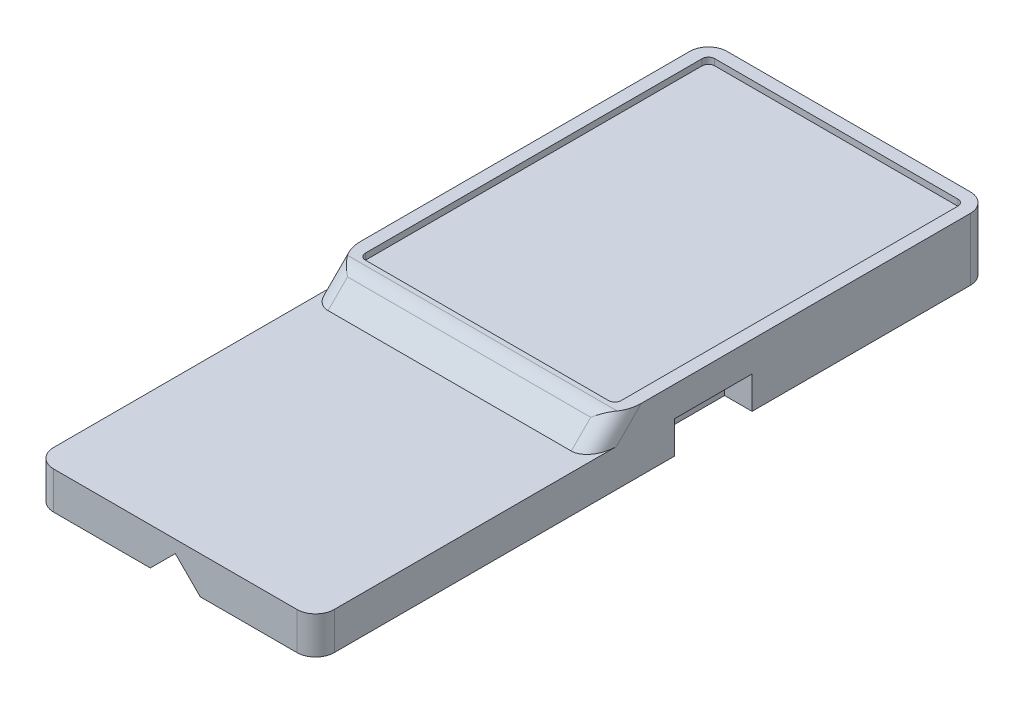
ISO-10303-21;
HEADER;
FILE_DESCRIPTION(('STEP AP214'),'2;1');
FILE_NAME('part.step','',(''),(''),'','','');
FILE_SCHEMA(('AUTOMOTIVE_DESIGN { 1 0 10303 214 1 1 1 1 }'));
ENDSEC;
DATA;
#1=APPLICATION_CONTEXT('core data for automotive mechanical design processes');
#2=APPLICATION_PROTOCOL_DEFINITION('international standard','automotive_design',2000,#1);
#3=PRODUCT_CONTEXT('',#1,'mechanical');
#4=PRODUCT('Part','Part','',(#3));
#5=PRODUCT_RELATED_PRODUCT_CATEGORY('part','',(#4));
#6=PRODUCT_DEFINITION_FORMATION('','',#4);
#7=PRODUCT_DEFINITION_CONTEXT('part definition',#1,'design');
#8=PRODUCT_DEFINITION('design','',#6,#7);
#9=PRODUCT_DEFINITION_SHAPE('','',#8);
#10=(LENGTH_UNIT() NAMED_UNIT(*) SI_UNIT(.MILLI.,.METRE.));
#11=(NAMED_UNIT(*) PLANE_ANGLE_UNIT() SI_UNIT($,.RADIAN.));
#12=(NAMED_UNIT(*) SI_UNIT($,.STERADIAN.) SOLID_ANGLE_UNIT());
#13=UNCERTAINTY_MEASURE_WITH_UNIT(LENGTH_MEASURE(1.E-05),#10,'distance_accuracy_value','');
#14=(GEOMETRIC_REPRESENTATION_CONTEXT(3) GLOBAL_UNCERTAINTY_ASSIGNED_CONTEXT((#13)) GLOBAL_UNIT_ASSIGNED_CONTEXT((#10,
#11,#12)) REPRESENTATION_CONTEXT('',''));
#15=CARTESIAN_POINT('',(0.,0.,0.));
#16=DIRECTION('',(0.,0.,1.));
#17=DIRECTION('',(1.,0.,0.));
#18=AXIS2_PLACEMENT_3D('',#15,#16,#17);
#19=CARTESIAN_POINT('',(0.,-4.5,0.));
#20=DIRECTION('',(0.,1.,0.));
#21=DIRECTION('',(0.,0.,1.));
#22=AXIS2_PLACEMENT_3D('',#19,#20,#21);
#23=PLANE('',#22);
#24=DIRECTION('',(1.,0.,0.));
#25=VECTOR('',#24,1.);
#26=CARTESIAN_POINT('',(-12.4,-4.5,39.));
#27=LINE('',#26,#25);
#28=CARTESIAN_POINT('',(0.850000000000001,-4.5,39.));
#29=VERTEX_POINT('',#28);
#30=CARTESIAN_POINT('',(8.6,-4.5,39.));
#31=VERTEX_POINT('',#30);
#32=EDGE_CURVE('E270',#29,#31,#27,.T.);
#33=ORIENTED_EDGE('',*,*,#32,.F.);
#34=DIRECTION('',(0.,0.,-1.));
#35=VECTOR('',#34,1.);
#36=CARTESIAN_POINT('',(0.850000000000001,-4.5,39.));
#37=LINE('',#36,#35);
#38=CARTESIAN_POINT('',(0.850000000000005,-4.5,-15.));
#39=VERTEX_POINT('',#38);
#40=EDGE_CURVE('E481',#29,#39,#37,.T.);
#41=ORIENTED_EDGE('',*,*,#40,.T.);
#42=DIRECTION('',(1.,0.,0.));
#43=VECTOR('',#42,1.);
#44=CARTESIAN_POINT('',(0.,-4.5,-15.));
#45=LINE('',#44,#43);
#46=CARTESIAN_POINT('',(8.6,-4.5,-15.));
#47=VERTEX_POINT('',#46);
#48=EDGE_CURVE('E281',#39,#47,#45,.T.);
#49=ORIENTED_EDGE('',*,*,#48,.T.);
#50=CARTESIAN_POINT('',(8.6,-4.5,-13.5));
#51=DIRECTION('',(0.,1.,0.));
#52=DIRECTION('',(0.,0.,1.));
#53=AXIS2_PLACEMENT_3D('',#50,#51,#52);
#54=CIRCLE('',#53,1.5);
#55=CARTESIAN_POINT('',(10.1,-4.5,-13.5));
#56=VERTEX_POINT('',#55);
#57=EDGE_CURVE('E306',#47,#56,#54,.F.);
#58=ORIENTED_EDGE('',*,*,#57,.T.);
#59=DIRECTION('',(0.,0.,-1.));
#60=VECTOR('',#59,1.);
#61=CARTESIAN_POINT('',(10.1,-4.5,0.));
#62=LINE('',#61,#60);
#63=CARTESIAN_POINT('',(10.1,-4.5,4.));
#64=VERTEX_POINT('',#63);
#65=EDGE_CURVE('E285',#64,#56,#62,.T.);
#66=ORIENTED_EDGE('',*,*,#65,.F.);
#67=DIRECTION('',(1.,0.,0.));
#68=VECTOR('',#67,1.);
#69=CARTESIAN_POINT('',(7.9,-4.5,4.));
#70=LINE('',#69,#68);
#71=CARTESIAN_POINT('',(7.9,-4.5,4.));
#72=VERTEX_POINT('',#71);
#73=EDGE_CURVE('E448',#72,#64,#70,.T.);
#74=ORIENTED_EDGE('',*,*,#73,.F.);
#75=DIRECTION('',(0.,0.,-1.));
#76=VECTOR('',#75,1.);
#77=CARTESIAN_POINT('',(7.9,-4.5,10.2));
#78=LINE('',#77,#76);
#79=CARTESIAN_POINT('',(7.9,-4.5,10.2));
#80=VERTEX_POINT('',#79);
#81=EDGE_CURVE('E460',#80,#72,#78,.T.);
#82=ORIENTED_EDGE('',*,*,#81,.F.);
#83=DIRECTION('',(-1.,0.,0.));
#84=VECTOR('',#83,1.);
#85=CARTESIAN_POINT('',(7.9,-4.5,10.2));
#86=LINE('',#85,#84);
#87=CARTESIAN_POINT('',(10.1,-4.5,10.2));
#88=VERTEX_POINT('',#87);
#89=EDGE_CURVE('E438',#88,#80,#86,.T.);
#90=ORIENTED_EDGE('',*,*,#89,.F.);
#91=CARTESIAN_POINT('',(10.1,-4.5,37.5));
#92=VERTEX_POINT('',#91);
#93=EDGE_CURVE('E286',#92,#88,#62,.T.);
#94=ORIENTED_EDGE('',*,*,#93,.F.);
#95=CARTESIAN_POINT('',(8.6,-4.5,37.5));
#96=DIRECTION('',(0.,1.,0.));
#97=DIRECTION('',(0.,0.,1.));
#98=AXIS2_PLACEMENT_3D('',#95,#96,#97);
#99=CIRCLE('',#98,1.5);
#100=EDGE_CURVE('E301',#92,#31,#99,.F.);
#101=ORIENTED_EDGE('',*,*,#100,.T.);
#102=EDGE_LOOP('',(#33,#41,#49,#58,#66,#74,#82,#90,#94,#101));
#103=FACE_BOUND('',#102,.T.);
#104=ADVANCED_FACE('F38',(#103),#23,.F.);
#105=CARTESIAN_POINT('',(-12.4,-4.5,0.));
#106=DIRECTION('',(-1.,0.,0.));
#107=DIRECTION('',(0.,0.,1.));
#108=AXIS2_PLACEMENT_3D('',#105,#106,#107);
#109=PLANE('',#108);
#110=DIRECTION('',(0.,0.,1.));
#111=VECTOR('',#110,1.);
#112=CARTESIAN_POINT('',(-12.4,-1.5,15.));
#113=LINE('',#112,#111);
#114=CARTESIAN_POINT('',(-12.4,-1.5,14.8786796564404));
#115=VERTEX_POINT('',#114);
#116=CARTESIAN_POINT('',(-12.4,-1.5,37.5));
#117=VERTEX_POINT('',#116);
#118=EDGE_CURVE('E269',#115,#117,#113,.T.);
#119=ORIENTED_EDGE('',*,*,#118,.F.);
#120=DIRECTION('',(0.,0.707106781186547,-0.707106781186549));
#121=VECTOR('',#120,1.);
#122=CARTESIAN_POINT('',(-12.4,4.43933982822018,8.93933982822016));
#123=LINE('',#122,#121);
#124=CARTESIAN_POINT('',(-12.4,0.5,12.8786796564404));
#125=VERTEX_POINT('',#124);
#126=EDGE_CURVE('E334',#115,#125,#123,.T.);
#127=ORIENTED_EDGE('',*,*,#126,.T.);
#128=DIRECTION('',(0.,0.,-1.));
#129=VECTOR('',#128,1.);
#130=CARTESIAN_POINT('',(-12.4,0.5,15.));
#131=LINE('',#130,#129);
#132=CARTESIAN_POINT('',(-12.4,0.5,-13.5));
#133=VERTEX_POINT('',#132);
#134=EDGE_CURVE('E509',#125,#133,#131,.T.);
#135=ORIENTED_EDGE('',*,*,#134,.T.);
#136=DIRECTION('',(0.,1.,0.));
#137=VECTOR('',#136,1.);
#138=CARTESIAN_POINT('',(-12.4,-4.5,-13.5));
#139=LINE('',#138,#137);
#140=CARTESIAN_POINT('',(-12.4,-4.5,-13.5));
#141=VERTEX_POINT('',#140);
#142=EDGE_CURVE('E312',#133,#141,#139,.F.);
#143=ORIENTED_EDGE('',*,*,#142,.T.);
#144=DIRECTION('',(0.,0.,1.));
#145=VECTOR('',#144,1.);
#146=CARTESIAN_POINT('',(-12.4,-4.5,0.));
#147=LINE('',#146,#145);
#148=CARTESIAN_POINT('',(-12.4,-4.5,4.));
#149=VERTEX_POINT('',#148);
#150=EDGE_CURVE('E282',#141,#149,#147,.T.);
#151=ORIENTED_EDGE('',*,*,#150,.T.);
#152=DIRECTION('',(0.,-1.,0.));
#153=VECTOR('',#152,1.);
#154=CARTESIAN_POINT('',(-12.4,-1.9,4.));
#155=LINE('',#154,#153);
#156=CARTESIAN_POINT('',(-12.4,-1.9,4.));
#157=VERTEX_POINT('',#156);
#158=EDGE_CURVE('E427',#157,#149,#155,.T.);
#159=ORIENTED_EDGE('',*,*,#158,.F.);
#160=DIRECTION('',(0.,0.,1.));
#161=VECTOR('',#160,1.);
#162=CARTESIAN_POINT('',(-12.4,-1.9,10.2));
#163=LINE('',#162,#161);
#164=CARTESIAN_POINT('',(-12.4,-1.9,10.2));
#165=VERTEX_POINT('',#164);
#166=EDGE_CURVE('E417',#157,#165,#163,.T.);
#167=ORIENTED_EDGE('',*,*,#166,.T.);
#168=DIRECTION('',(0.,-1.,0.));
#169=VECTOR('',#168,1.);
#170=CARTESIAN_POINT('',(-12.4,-1.9,10.2));
#171=LINE('',#170,#169);
#172=CARTESIAN_POINT('',(-12.4,-4.5,10.2));
#173=VERTEX_POINT('',#172);
#174=EDGE_CURVE('E435',#165,#173,#171,.T.);
#175=ORIENTED_EDGE('',*,*,#174,.T.);
#176=CARTESIAN_POINT('',(-12.4,-4.5,37.5));
#177=VERTEX_POINT('',#176);
#178=EDGE_CURVE('E280',#173,#177,#147,.T.);
#179=ORIENTED_EDGE('',*,*,#178,.T.);
#180=DIRECTION('',(0.,-1.,0.));
#181=VECTOR('',#180,1.);
#182=CARTESIAN_POINT('',(-12.4,-1.5,37.5));
#183=LINE('',#182,#181);
#184=EDGE_CURVE('E309',#177,#117,#183,.F.);
#185=ORIENTED_EDGE('',*,*,#184,.T.);
#186=EDGE_LOOP('',(#119,#127,#135,#143,#151,#159,#167,#175,#179,#185));
#187=FACE_BOUND('',#186,.T.);
#188=ADVANCED_FACE('F545',(#187),#109,.T.);
#189=CARTESIAN_POINT('',(-10.9,-4.5,-15.));
#190=VERTEX_POINT('',#189);
#191=CARTESIAN_POINT('',(-3.15,-4.5,-15.));
#192=VERTEX_POINT('',#191);
#193=EDGE_CURVE('E262',#190,#192,#45,.T.);
#194=ORIENTED_EDGE('',*,*,#193,.T.);
#195=DIRECTION('',(0.,0.,-1.));
#196=VECTOR('',#195,1.);
#197=CARTESIAN_POINT('',(-3.15,-4.5,39.));
#198=LINE('',#197,#196);
#199=CARTESIAN_POINT('',(-3.15,-4.5,39.));
#200=VERTEX_POINT('',#199);
#201=EDGE_CURVE('E249',#200,#192,#198,.T.);
#202=ORIENTED_EDGE('',*,*,#201,.F.);
#203=CARTESIAN_POINT('',(-10.9,-4.5,39.));
#204=VERTEX_POINT('',#203);
#205=EDGE_CURVE('E260',#204,#200,#27,.T.);
#206=ORIENTED_EDGE('',*,*,#205,.F.);
#207=CARTESIAN_POINT('',(-10.9,-4.5,37.5));
#208=DIRECTION('',(0.,1.,0.));
#209=DIRECTION('',(0.,0.,1.));
#210=AXIS2_PLACEMENT_3D('',#207,#208,#209);
#211=CIRCLE('',#210,1.5);
#212=EDGE_CURVE('E299',#204,#177,#211,.F.);
#213=ORIENTED_EDGE('',*,*,#212,.T.);
#214=ORIENTED_EDGE('',*,*,#178,.F.);
#215=DIRECTION('',(1.,0.,0.));
#216=VECTOR('',#215,1.);
#217=CARTESIAN_POINT('',(-10.2,-4.5,10.2));
#218=LINE('',#217,#216);
#219=CARTESIAN_POINT('',(-10.2,-4.5,10.2));
#220=VERTEX_POINT('',#219);
#221=EDGE_CURVE('E421',#173,#220,#218,.T.);
#222=ORIENTED_EDGE('',*,*,#221,.T.);
#223=DIRECTION('',(0.,0.,-1.));
#224=VECTOR('',#223,1.);
#225=CARTESIAN_POINT('',(-10.2,-4.5,10.2));
#226=LINE('',#225,#224);
#227=CARTESIAN_POINT('',(-10.2,-4.5,4.));
#228=VERTEX_POINT('',#227);
#229=EDGE_CURVE('E430',#220,#228,#226,.T.);
#230=ORIENTED_EDGE('',*,*,#229,.T.);
#231=DIRECTION('',(-1.,0.,0.));
#232=VECTOR('',#231,1.);
#233=CARTESIAN_POINT('',(-10.2,-4.5,4.));
#234=LINE('',#233,#232);
#235=EDGE_CURVE('E416',#228,#149,#234,.T.);
#236=ORIENTED_EDGE('',*,*,#235,.T.);
#237=ORIENTED_EDGE('',*,*,#150,.F.);
#238=CARTESIAN_POINT('',(-10.9,-4.5,-13.5));
#239=DIRECTION('',(0.,1.,0.));
#240=DIRECTION('',(0.,0.,1.));
#241=AXIS2_PLACEMENT_3D('',#238,#239,#240);
#242=CIRCLE('',#241,1.5);
#243=EDGE_CURVE('E304',#141,#190,#242,.F.);
#244=ORIENTED_EDGE('',*,*,#243,.T.);
#245=EDGE_LOOP('',(#194,#202,#206,#213,#214,#222,#230,#236,#237,#244));
#246=FACE_BOUND('',#245,.T.);
#247=ADVANCED_FACE('F258',(#246),#23,.F.);
#248=CARTESIAN_POINT('',(0.,-4.5,-15.));
#249=DIRECTION('',(0.,0.,1.));
#250=DIRECTION('',(1.,0.,0.));
#251=AXIS2_PLACEMENT_3D('',#248,#249,#250);
#252=PLANE('',#251);
#253=ORIENTED_EDGE('',*,*,#48,.F.);
#254=DIRECTION('',(-0.707106781186547,0.707106781186548,0.));
#255=VECTOR('',#254,1.);
#256=CARTESIAN_POINT('',(0.425000000000002,-4.075,-15.));
#257=LINE('',#256,#255);
#258=CARTESIAN_POINT('',(-1.15,-2.5,-15.));
#259=VERTEX_POINT('',#258);
#260=EDGE_CURVE('E604',#39,#259,#257,.T.);
#261=ORIENTED_EDGE('',*,*,#260,.T.);
#262=DIRECTION('',(-0.707106781186548,-0.707106781186547,0.));
#263=VECTOR('',#262,1.);
#264=CARTESIAN_POINT('',(-1.575,-2.925,-15.));
#265=LINE('',#264,#263);
#266=EDGE_CURVE('E607',#259,#192,#265,.T.);
#267=ORIENTED_EDGE('',*,*,#266,.T.);
#268=ORIENTED_EDGE('',*,*,#193,.F.);
#269=DIRECTION('',(0.,1.,0.));
#270=VECTOR('',#269,1.);
#271=CARTESIAN_POINT('',(-10.9,0.,-15.));
#272=LINE('',#271,#270);
#273=CARTESIAN_POINT('',(-10.9,0.5,-15.));
#274=VERTEX_POINT('',#273);
#275=EDGE_CURVE('E294',#190,#274,#272,.T.);
#276=ORIENTED_EDGE('',*,*,#275,.T.);
#277=DIRECTION('',(1.,0.,0.));
#278=VECTOR('',#277,1.);
#279=CARTESIAN_POINT('',(8.6,0.5,-15.));
#280=LINE('',#279,#278);
#281=CARTESIAN_POINT('',(8.6,0.5,-15.));
#282=VERTEX_POINT('',#281);
#283=EDGE_CURVE('E487',#274,#282,#280,.T.);
#284=ORIENTED_EDGE('',*,*,#283,.T.);
#285=DIRECTION('',(0.,1.,0.));
#286=VECTOR('',#285,1.);
#287=CARTESIAN_POINT('',(8.6,-4.5,-15.));
#288=LINE('',#287,#286);
#289=EDGE_CURVE('E296',#282,#47,#288,.F.);
#290=ORIENTED_EDGE('',*,*,#289,.T.);
#291=EDGE_LOOP('',(#253,#261,#267,#268,#276,#284,#290));
#292=FACE_BOUND('',#291,.T.);
#293=ADVANCED_FACE('F485',(#292),#252,.F.);
#294=CARTESIAN_POINT('',(10.1,-4.5,0.));
#295=DIRECTION('',(1.,0.,0.));
#296=DIRECTION('',(0.,0.,-1.));
#297=AXIS2_PLACEMENT_3D('',#294,#295,#296);
#298=PLANE('',#297);
#299=DIRECTION('',(0.,0.,1.));
#300=VECTOR('',#299,1.);
#301=CARTESIAN_POINT('',(10.1,0.5,15.));
#302=LINE('',#301,#300);
#303=CARTESIAN_POINT('',(10.1,0.5,-13.5));
#304=VERTEX_POINT('',#303);
#305=CARTESIAN_POINT('',(10.1,0.5,12.8786796564404));
#306=VERTEX_POINT('',#305);
#307=EDGE_CURVE('E497',#304,#306,#302,.T.);
#308=ORIENTED_EDGE('',*,*,#307,.T.);
#309=DIRECTION('',(0.,0.707106781186547,-0.707106781186549));
#310=VECTOR('',#309,1.);
#311=CARTESIAN_POINT('',(10.1,4.43933982822018,8.93933982822016));
#312=LINE('',#311,#310);
#313=CARTESIAN_POINT('',(10.1,-1.5,14.8786796564404));
#314=VERTEX_POINT('',#313);
#315=EDGE_CURVE('E331',#306,#314,#312,.F.);
#316=ORIENTED_EDGE('',*,*,#315,.T.);
#317=DIRECTION('',(0.,0.,-1.));
#318=VECTOR('',#317,1.);
#319=CARTESIAN_POINT('',(10.1,-1.5,15.));
#320=LINE('',#319,#318);
#321=CARTESIAN_POINT('',(10.1,-1.5,37.5));
#322=VERTEX_POINT('',#321);
#323=EDGE_CURVE('E277',#322,#314,#320,.T.);
#324=ORIENTED_EDGE('',*,*,#323,.F.);
#325=DIRECTION('',(0.,-1.,0.));
#326=VECTOR('',#325,1.);
#327=CARTESIAN_POINT('',(10.1,-4.5,37.5));
#328=LINE('',#327,#326);
#329=EDGE_CURVE('E289',#322,#92,#328,.T.);
#330=ORIENTED_EDGE('',*,*,#329,.T.);
#331=ORIENTED_EDGE('',*,*,#93,.T.);
#332=DIRECTION('',(0.,-1.,0.));
#333=VECTOR('',#332,1.);
#334=CARTESIAN_POINT('',(10.1,-1.9,10.2));
#335=LINE('',#334,#333);
#336=CARTESIAN_POINT('',(10.1,-1.9,10.2));
#337=VERTEX_POINT('',#336);
#338=EDGE_CURVE('E457',#337,#88,#335,.T.);
#339=ORIENTED_EDGE('',*,*,#338,.F.);
#340=DIRECTION('',(0.,0.,1.));
#341=VECTOR('',#340,1.);
#342=CARTESIAN_POINT('',(10.1,-1.9,10.2));
#343=LINE('',#342,#341);
#344=CARTESIAN_POINT('',(10.1,-1.9,4.));
#345=VERTEX_POINT('',#344);
#346=EDGE_CURVE('E444',#345,#337,#343,.T.);
#347=ORIENTED_EDGE('',*,*,#346,.F.);
#348=DIRECTION('',(0.,-1.,0.));
#349=VECTOR('',#348,1.);
#350=CARTESIAN_POINT('',(10.1,-1.9,4.));
#351=LINE('',#350,#349);
#352=EDGE_CURVE('E274',#345,#64,#351,.T.);
#353=ORIENTED_EDGE('',*,*,#352,.T.);
#354=ORIENTED_EDGE('',*,*,#65,.T.);
#355=DIRECTION('',(0.,1.,0.));
#356=VECTOR('',#355,1.);
#357=CARTESIAN_POINT('',(10.1,0.,-13.5));
#358=LINE('',#357,#356);
#359=EDGE_CURVE('E292',#56,#304,#358,.T.);
#360=ORIENTED_EDGE('',*,*,#359,.T.);
#361=EDGE_LOOP('',(#308,#316,#324,#330,#331,#339,#347,#353,#354,#360));
#362=FACE_BOUND('',#361,.T.);
#363=ADVANCED_FACE('F496',(#362),#298,.T.);
#364=CARTESIAN_POINT('',(0.,0.,0.));
#365=DIRECTION('',(0.,1.,0.));
#366=DIRECTION('',(0.,0.,1.));
#367=AXIS2_PLACEMENT_3D('',#364,#365,#366);
#368=PLANE('',#367);
#369=DIRECTION('',(0.,0.,-1.));
#370=VECTOR('',#369,1.);
#371=CARTESIAN_POINT('',(-11.4,0.,15.));
#372=LINE('',#371,#370);
#373=CARTESIAN_POINT('',(-11.4,0.,13.5));
#374=VERTEX_POINT('',#373);
#375=CARTESIAN_POINT('',(-11.4,0.,-13.5));
#376=VERTEX_POINT('',#375);
#377=EDGE_CURVE('E390',#374,#376,#372,.T.);
#378=ORIENTED_EDGE('',*,*,#377,.F.);
#379=CARTESIAN_POINT('',(-10.9,0.,13.5));
#380=DIRECTION('',(0.,1.,0.));
#381=DIRECTION('',(0.,0.,1.));
#382=AXIS2_PLACEMENT_3D('',#379,#380,#381);
#383=CIRCLE('',#382,0.5);
#384=CARTESIAN_POINT('',(-10.9,0.,14.));
#385=VERTEX_POINT('',#384);
#386=EDGE_CURVE('E347',#374,#385,#383,.T.);
#387=ORIENTED_EDGE('',*,*,#386,.T.);
#388=DIRECTION('',(-1.,0.,0.));
#389=VECTOR('',#388,1.);
#390=CARTESIAN_POINT('',(0.,0.,14.));
#391=LINE('',#390,#389);
#392=CARTESIAN_POINT('',(8.6,0.,14.));
#393=VERTEX_POINT('',#392);
#394=EDGE_CURVE('E375',#393,#385,#391,.T.);
#395=ORIENTED_EDGE('',*,*,#394,.F.);
#396=CARTESIAN_POINT('',(8.6,0.,13.5));
#397=DIRECTION('',(0.,1.,0.));
#398=DIRECTION('',(0.,0.,1.));
#399=AXIS2_PLACEMENT_3D('',#396,#397,#398);
#400=CIRCLE('',#399,0.5);
#401=CARTESIAN_POINT('',(9.1,0.,13.5));
#402=VERTEX_POINT('',#401);
#403=EDGE_CURVE('E345',#393,#402,#400,.T.);
#404=ORIENTED_EDGE('',*,*,#403,.T.);
#405=DIRECTION('',(0.,0.,-1.));
#406=VECTOR('',#405,1.);
#407=CARTESIAN_POINT('',(9.1,0.,15.));
#408=LINE('',#407,#406);
#409=CARTESIAN_POINT('',(9.1,0.,-13.5));
#410=VERTEX_POINT('',#409);
#411=EDGE_CURVE('E383',#410,#402,#408,.F.);
#412=ORIENTED_EDGE('',*,*,#411,.F.);
#413=CARTESIAN_POINT('',(8.6,0.,-13.5));
#414=DIRECTION('',(0.,1.,0.));
#415=DIRECTION('',(1.,0.,0.));
#416=AXIS2_PLACEMENT_3D('',#413,#414,#415);
#417=CIRCLE('',#416,0.500000000000001);
#418=CARTESIAN_POINT('',(8.6,0.,-14.));
#419=VERTEX_POINT('',#418);
#420=EDGE_CURVE('E404',#419,#410,#417,.F.);
#421=ORIENTED_EDGE('',*,*,#420,.F.);
#422=DIRECTION('',(1.,0.,0.));
#423=VECTOR('',#422,1.);
#424=CARTESIAN_POINT('',(8.6,0.,-14.));
#425=LINE('',#424,#423);
#426=CARTESIAN_POINT('',(-10.9,0.,-14.));
#427=VERTEX_POINT('',#426);
#428=EDGE_CURVE('E401',#427,#419,#425,.T.);
#429=ORIENTED_EDGE('',*,*,#428,.F.);
#430=CARTESIAN_POINT('',(-10.9,0.,-13.5));
#431=DIRECTION('',(0.,1.,0.));
#432=DIRECTION('',(1.,0.,0.));
#433=AXIS2_PLACEMENT_3D('',#430,#431,#432);
#434=CIRCLE('',#433,0.500000000000001);
#435=EDGE_CURVE('E392',#376,#427,#434,.F.);
#436=ORIENTED_EDGE('',*,*,#435,.F.);
#437=EDGE_LOOP('',(#378,#387,#395,#404,#412,#421,#429,#436));
#438=FACE_BOUND('',#437,.T.);
#439=ADVANCED_FACE('F382',(#438),#368,.T.);
#440=CARTESIAN_POINT('',(-12.4,-1.5,39.));
#441=DIRECTION('',(0.,0.,-1.));
#442=DIRECTION('',(-1.,0.,0.));
#443=AXIS2_PLACEMENT_3D('',#440,#441,#442);
#444=PLANE('',#443);
#445=DIRECTION('',(0.707106781186548,0.707106781186547,0.));
#446=VECTOR('',#445,1.);
#447=CARTESIAN_POINT('',(-1.15,-2.5,39.));
#448=LINE('',#447,#446);
#449=CARTESIAN_POINT('',(-1.15,-2.5,39.));
#450=VERTEX_POINT('',#449);
#451=EDGE_CURVE('E246',#200,#450,#448,.T.);
#452=ORIENTED_EDGE('',*,*,#451,.T.);
#453=DIRECTION('',(0.707106781186547,-0.707106781186548,0.));
#454=VECTOR('',#453,1.);
#455=CARTESIAN_POINT('',(0.850000000000001,-4.5,39.));
#456=LINE('',#455,#454);
#457=EDGE_CURVE('E53',#450,#29,#456,.T.);
#458=ORIENTED_EDGE('',*,*,#457,.T.);
#459=ORIENTED_EDGE('',*,*,#32,.T.);
#460=DIRECTION('',(0.,-1.,0.));
#461=VECTOR('',#460,1.);
#462=CARTESIAN_POINT('',(8.6,-1.5,39.));
#463=LINE('',#462,#461);
#464=CARTESIAN_POINT('',(8.6,-1.5,39.));
#465=VERTEX_POINT('',#464);
#466=EDGE_CURVE('E315',#31,#465,#463,.F.);
#467=ORIENTED_EDGE('',*,*,#466,.T.);
#468=DIRECTION('',(1.,0.,0.));
#469=VECTOR('',#468,1.);
#470=CARTESIAN_POINT('',(-12.4,-1.5,39.));
#471=LINE('',#470,#469);
#472=CARTESIAN_POINT('',(-10.9,-1.5,39.));
#473=VERTEX_POINT('',#472);
#474=EDGE_CURVE('E272',#473,#465,#471,.T.);
#475=ORIENTED_EDGE('',*,*,#474,.F.);
#476=DIRECTION('',(0.,-1.,0.));
#477=VECTOR('',#476,1.);
#478=CARTESIAN_POINT('',(-10.9,-4.5,39.));
#479=LINE('',#478,#477);
#480=EDGE_CURVE('E268',#473,#204,#479,.T.);
#481=ORIENTED_EDGE('',*,*,#480,.T.);
#482=ORIENTED_EDGE('',*,*,#205,.T.);
#483=EDGE_LOOP('',(#452,#458,#459,#467,#475,#481,#482));
#484=FACE_BOUND('',#483,.T.);
#485=ADVANCED_FACE('F265',(#484),#444,.F.);
#486=CARTESIAN_POINT('',(0.,-1.5,0.));
#487=DIRECTION('',(0.,1.,0.));
#488=DIRECTION('',(0.,0.,1.));
#489=AXIS2_PLACEMENT_3D('',#486,#487,#488);
#490=PLANE('',#489);
#491=ORIENTED_EDGE('',*,*,#118,.T.);
#492=CARTESIAN_POINT('',(-10.9,-1.5,37.5));
#493=DIRECTION('',(0.,1.,0.));
#494=DIRECTION('',(0.,0.,1.));
#495=AXIS2_PLACEMENT_3D('',#492,#493,#494);
#496=CIRCLE('',#495,1.5);
#497=EDGE_CURVE('E317',#117,#473,#496,.T.);
#498=ORIENTED_EDGE('',*,*,#497,.T.);
#499=ORIENTED_EDGE('',*,*,#474,.T.);
#500=CARTESIAN_POINT('',(8.6,-1.5,37.5));
#501=DIRECTION('',(0.,1.,0.));
#502=DIRECTION('',(0.,0.,1.));
#503=AXIS2_PLACEMENT_3D('',#500,#501,#502);
#504=CIRCLE('',#503,1.5);
#505=EDGE_CURVE('E319',#465,#322,#504,.T.);
#506=ORIENTED_EDGE('',*,*,#505,.T.);
#507=ORIENTED_EDGE('',*,*,#323,.T.);
#508=CARTESIAN_POINT('',(8.6,-1.5,14.8786796564404));
#509=DIRECTION('',(0.,1.,0.));
#510=DIRECTION('',(0.,0.,-1.));
#511=AXIS2_PLACEMENT_3D('',#508,#509,#510);
#512=ELLIPSE('',#511,2.12132034355965,1.5);
#513=CARTESIAN_POINT('',(8.6,-1.5,17.));
#514=VERTEX_POINT('',#513);
#515=EDGE_CURVE('E337',#314,#514,#512,.F.);
#516=ORIENTED_EDGE('',*,*,#515,.T.);
#517=DIRECTION('',(-1.,0.,0.));
#518=VECTOR('',#517,1.);
#519=CARTESIAN_POINT('',(13.705551275464,-1.5,17.));
#520=LINE('',#519,#518);
#521=CARTESIAN_POINT('',(-10.9,-1.5,17.));
#522=VERTEX_POINT('',#521);
#523=EDGE_CURVE('E376',#514,#522,#520,.T.);
#524=ORIENTED_EDGE('',*,*,#523,.T.);
#525=CARTESIAN_POINT('',(-10.9,-1.5,14.8786796564404));
#526=DIRECTION('',(0.,1.,0.));
#527=DIRECTION('',(0.,0.,-1.));
#528=AXIS2_PLACEMENT_3D('',#525,#526,#527);
#529=ELLIPSE('',#528,2.12132034355965,1.5);
#530=EDGE_CURVE('E339',#522,#115,#529,.F.);
#531=ORIENTED_EDGE('',*,*,#530,.T.);
#532=EDGE_LOOP('',(#491,#498,#499,#506,#507,#516,#524,#531));
#533=FACE_BOUND('',#532,.T.);
#534=ADVANCED_FACE('F569',(#533),#490,.T.);
#535=CARTESIAN_POINT('',(8.6,-4.5,-13.5));
#536=DIRECTION('',(0.,-1.,0.));
#537=DIRECTION('',(0.,0.,-1.));
#538=AXIS2_PLACEMENT_3D('',#535,#536,#537);
#539=CYLINDRICAL_SURFACE('',#538,1.5);
#540=ORIENTED_EDGE('',*,*,#57,.F.);
#541=ORIENTED_EDGE('',*,*,#289,.F.);
#542=CARTESIAN_POINT('',(8.6,0.5,-13.5));
#543=DIRECTION('',(0.,-1.,0.));
#544=DIRECTION('',(0.,0.,1.));
#545=AXIS2_PLACEMENT_3D('',#542,#543,#544);
#546=CIRCLE('',#545,1.5);
#547=EDGE_CURVE('E492',#282,#304,#546,.T.);
#548=ORIENTED_EDGE('',*,*,#547,.T.);
#549=ORIENTED_EDGE('',*,*,#359,.F.);
#550=EDGE_LOOP('',(#540,#541,#548,#549));
#551=FACE_BOUND('',#550,.T.);
#552=ADVANCED_FACE('F491',(#551),#539,.T.);
#553=CARTESIAN_POINT('',(-10.9,-4.5,-13.5));
#554=DIRECTION('',(0.,-1.,0.));
#555=DIRECTION('',(0.,0.,-1.));
#556=AXIS2_PLACEMENT_3D('',#553,#554,#555);
#557=CYLINDRICAL_SURFACE('',#556,1.5);
#558=ORIENTED_EDGE('',*,*,#243,.F.);
#559=ORIENTED_EDGE('',*,*,#142,.F.);
#560=CARTESIAN_POINT('',(-10.9,0.5,-13.5));
#561=DIRECTION('',(0.,-1.,0.));
#562=DIRECTION('',(0.,0.,-1.));
#563=AXIS2_PLACEMENT_3D('',#560,#561,#562);
#564=CIRCLE('',#563,1.5);
#565=EDGE_CURVE('E506',#133,#274,#564,.T.);
#566=ORIENTED_EDGE('',*,*,#565,.T.);
#567=ORIENTED_EDGE('',*,*,#275,.F.);
#568=EDGE_LOOP('',(#558,#559,#566,#567));
#569=FACE_BOUND('',#568,.T.);
#570=ADVANCED_FACE('F568',(#569),#557,.T.);
#571=CARTESIAN_POINT('',(8.6,-4.5,37.5));
#572=DIRECTION('',(0.,1.,0.));
#573=DIRECTION('',(0.,0.,1.));
#574=AXIS2_PLACEMENT_3D('',#571,#572,#573);
#575=CYLINDRICAL_SURFACE('',#574,1.5);
#576=ORIENTED_EDGE('',*,*,#505,.F.);
#577=ORIENTED_EDGE('',*,*,#466,.F.);
#578=ORIENTED_EDGE('',*,*,#100,.F.);
#579=ORIENTED_EDGE('',*,*,#329,.F.);
#580=EDGE_LOOP('',(#576,#577,#578,#579));
#581=FACE_BOUND('',#580,.T.);
#582=ADVANCED_FACE('F572',(#581),#575,.T.);
#583=CARTESIAN_POINT('',(-10.9,-1.5,37.5));
#584=DIRECTION('',(0.,1.,0.));
#585=DIRECTION('',(0.,0.,1.));
#586=AXIS2_PLACEMENT_3D('',#583,#584,#585);
#587=CYLINDRICAL_SURFACE('',#586,1.5);
#588=ORIENTED_EDGE('',*,*,#497,.F.);
#589=ORIENTED_EDGE('',*,*,#184,.F.);
#590=ORIENTED_EDGE('',*,*,#212,.F.);
#591=ORIENTED_EDGE('',*,*,#480,.F.);
#592=EDGE_LOOP('',(#588,#589,#590,#591));
#593=FACE_BOUND('',#592,.T.);
#594=ADVANCED_FACE('F576',(#593),#587,.T.);
#595=CARTESIAN_POINT('',(7.9,-1.9,4.));
#596=DIRECTION('',(0.,0.,-1.));
#597=DIRECTION('',(-1.,0.,0.));
#598=AXIS2_PLACEMENT_3D('',#595,#596,#597);
#599=PLANE('',#598);
#600=ORIENTED_EDGE('',*,*,#73,.T.);
#601=ORIENTED_EDGE('',*,*,#352,.F.);
#602=DIRECTION('',(1.,0.,0.));
#603=VECTOR('',#602,1.);
#604=CARTESIAN_POINT('',(7.9,-1.9,4.));
#605=LINE('',#604,#603);
#606=CARTESIAN_POINT('',(7.9,-1.9,4.));
#607=VERTEX_POINT('',#606);
#608=EDGE_CURVE('E454',#607,#345,#605,.T.);
#609=ORIENTED_EDGE('',*,*,#608,.F.);
#610=DIRECTION('',(0.,-1.,0.));
#611=VECTOR('',#610,1.);
#612=CARTESIAN_POINT('',(7.9,-1.9,4.));
#613=LINE('',#612,#611);
#614=EDGE_CURVE('E466',#607,#72,#613,.T.);
#615=ORIENTED_EDGE('',*,*,#614,.T.);
#616=EDGE_LOOP('',(#600,#601,#609,#615));
#617=FACE_BOUND('',#616,.T.);
#618=ADVANCED_FACE('F580',(#617),#599,.F.);
#619=CARTESIAN_POINT('',(7.9,-1.9,10.2));
#620=DIRECTION('',(-1.,0.,0.));
#621=DIRECTION('',(0.,0.,1.));
#622=AXIS2_PLACEMENT_3D('',#619,#620,#621);
#623=PLANE('',#622);
#624=ORIENTED_EDGE('',*,*,#81,.T.);
#625=ORIENTED_EDGE('',*,*,#614,.F.);
#626=DIRECTION('',(0.,0.,-1.));
#627=VECTOR('',#626,1.);
#628=CARTESIAN_POINT('',(7.9,-1.9,10.2));
#629=LINE('',#628,#627);
#630=CARTESIAN_POINT('',(7.9,-1.9,10.2));
#631=VERTEX_POINT('',#630);
#632=EDGE_CURVE('E451',#631,#607,#629,.T.);
#633=ORIENTED_EDGE('',*,*,#632,.F.);
#634=DIRECTION('',(0.,-1.,0.));
#635=VECTOR('',#634,1.);
#636=CARTESIAN_POINT('',(7.9,-1.9,10.2));
#637=LINE('',#636,#635);
#638=EDGE_CURVE('E468',#631,#80,#637,.T.);
#639=ORIENTED_EDGE('',*,*,#638,.T.);
#640=EDGE_LOOP('',(#624,#625,#633,#639));
#641=FACE_BOUND('',#640,.T.);
#642=ADVANCED_FACE('F647',(#641),#623,.F.);
#643=CARTESIAN_POINT('',(7.9,-1.9,10.2));
#644=DIRECTION('',(0.,0.,1.));
#645=DIRECTION('',(1.,0.,0.));
#646=AXIS2_PLACEMENT_3D('',#643,#644,#645);
#647=PLANE('',#646);
#648=ORIENTED_EDGE('',*,*,#89,.T.);
#649=ORIENTED_EDGE('',*,*,#638,.F.);
#650=DIRECTION('',(-1.,0.,0.));
#651=VECTOR('',#650,1.);
#652=CARTESIAN_POINT('',(7.9,-1.9,10.2));
#653=LINE('',#652,#651);
#654=EDGE_CURVE('E447',#337,#631,#653,.T.);
#655=ORIENTED_EDGE('',*,*,#654,.F.);
#656=ORIENTED_EDGE('',*,*,#338,.T.);
#657=EDGE_LOOP('',(#648,#649,#655,#656));
#658=FACE_BOUND('',#657,.T.);
#659=ADVANCED_FACE('F643',(#658),#647,.F.);
#660=CARTESIAN_POINT('',(0.,-1.9,0.));
#661=DIRECTION('',(0.,-1.,0.));
#662=DIRECTION('',(0.,0.,-1.));
#663=AXIS2_PLACEMENT_3D('',#660,#661,#662);
#664=PLANE('',#663);
#665=ORIENTED_EDGE('',*,*,#346,.T.);
#666=ORIENTED_EDGE('',*,*,#654,.T.);
#667=ORIENTED_EDGE('',*,*,#632,.T.);
#668=ORIENTED_EDGE('',*,*,#608,.T.);
#669=EDGE_LOOP('',(#665,#666,#667,#668));
#670=FACE_BOUND('',#669,.T.);
#671=ADVANCED_FACE('F646',(#670),#664,.T.);
#672=CARTESIAN_POINT('',(-10.2,-1.9,10.2));
#673=DIRECTION('',(0.,0.,-1.));
#674=DIRECTION('',(-1.,0.,0.));
#675=AXIS2_PLACEMENT_3D('',#672,#673,#674);
#676=PLANE('',#675);
#677=ORIENTED_EDGE('',*,*,#221,.F.);
#678=ORIENTED_EDGE('',*,*,#174,.F.);
#679=DIRECTION('',(1.,0.,0.));
#680=VECTOR('',#679,1.);
#681=CARTESIAN_POINT('',(-10.2,-1.9,10.2));
#682=LINE('',#681,#680);
#683=CARTESIAN_POINT('',(-10.2,-1.9,10.2));
#684=VERTEX_POINT('',#683);
#685=EDGE_CURVE('E425',#165,#684,#682,.T.);
#686=ORIENTED_EDGE('',*,*,#685,.T.);
#687=DIRECTION('',(0.,-1.,0.));
#688=VECTOR('',#687,1.);
#689=CARTESIAN_POINT('',(-10.2,-1.9,10.2));
#690=LINE('',#689,#688);
#691=EDGE_CURVE('E439',#684,#220,#690,.T.);
#692=ORIENTED_EDGE('',*,*,#691,.T.);
#693=EDGE_LOOP('',(#677,#678,#686,#692));
#694=FACE_BOUND('',#693,.T.);
#695=ADVANCED_FACE('F622',(#694),#676,.T.);
#696=CARTESIAN_POINT('',(-10.2,-1.9,10.2));
#697=DIRECTION('',(-1.,0.,0.));
#698=DIRECTION('',(0.,0.,1.));
#699=AXIS2_PLACEMENT_3D('',#696,#697,#698);
#700=PLANE('',#699);
#701=ORIENTED_EDGE('',*,*,#229,.F.);
#702=ORIENTED_EDGE('',*,*,#691,.F.);
#703=DIRECTION('',(0.,0.,-1.));
#704=VECTOR('',#703,1.);
#705=CARTESIAN_POINT('',(-10.2,-1.9,10.2));
#706=LINE('',#705,#704);
#707=CARTESIAN_POINT('',(-10.2,-1.9,4.));
#708=VERTEX_POINT('',#707);
#709=EDGE_CURVE('E423',#684,#708,#706,.T.);
#710=ORIENTED_EDGE('',*,*,#709,.T.);
#711=DIRECTION('',(0.,-1.,0.));
#712=VECTOR('',#711,1.);
#713=CARTESIAN_POINT('',(-10.2,-1.9,4.));
#714=LINE('',#713,#712);
#715=EDGE_CURVE('E441',#708,#228,#714,.T.);
#716=ORIENTED_EDGE('',*,*,#715,.T.);
#717=EDGE_LOOP('',(#701,#702,#710,#716));
#718=FACE_BOUND('',#717,.T.);
#719=ADVANCED_FACE('F627',(#718),#700,.T.);
#720=CARTESIAN_POINT('',(-10.2,-1.9,4.));
#721=DIRECTION('',(0.,0.,1.));
#722=DIRECTION('',(1.,0.,0.));
#723=AXIS2_PLACEMENT_3D('',#720,#721,#722);
#724=PLANE('',#723);
#725=ORIENTED_EDGE('',*,*,#235,.F.);
#726=ORIENTED_EDGE('',*,*,#715,.F.);
#727=DIRECTION('',(-1.,0.,0.));
#728=VECTOR('',#727,1.);
#729=CARTESIAN_POINT('',(-10.2,-1.9,4.));
#730=LINE('',#729,#728);
#731=EDGE_CURVE('E420',#708,#157,#730,.T.);
#732=ORIENTED_EDGE('',*,*,#731,.T.);
#733=ORIENTED_EDGE('',*,*,#158,.T.);
#734=EDGE_LOOP('',(#725,#726,#732,#733));
#735=FACE_BOUND('',#734,.T.);
#736=ADVANCED_FACE('F658',(#735),#724,.T.);
#737=CARTESIAN_POINT('',(-2.29999999999999,-1.9,0.));
#738=DIRECTION('',(0.,-1.,0.));
#739=DIRECTION('',(0.,0.,-1.));
#740=AXIS2_PLACEMENT_3D('',#737,#738,#739);
#741=PLANE('',#740);
#742=ORIENTED_EDGE('',*,*,#166,.F.);
#743=ORIENTED_EDGE('',*,*,#731,.F.);
#744=ORIENTED_EDGE('',*,*,#709,.F.);
#745=ORIENTED_EDGE('',*,*,#685,.F.);
#746=EDGE_LOOP('',(#742,#743,#744,#745));
#747=FACE_BOUND('',#746,.T.);
#748=ADVANCED_FACE('F661',(#747),#741,.T.);
#749=CARTESIAN_POINT('',(9.1,0.5,15.));
#750=DIRECTION('',(1.,0.,0.));
#751=DIRECTION('',(0.,0.,-1.));
#752=AXIS2_PLACEMENT_3D('',#749,#750,#751);
#753=PLANE('',#752);
#754=ORIENTED_EDGE('',*,*,#411,.T.);
#755=DIRECTION('',(0.,1.,0.));
#756=VECTOR('',#755,1.);
#757=CARTESIAN_POINT('',(9.1,0.5,13.5));
#758=LINE('',#757,#756);
#759=CARTESIAN_POINT('',(9.1,0.5,13.5));
#760=VERTEX_POINT('',#759);
#761=EDGE_CURVE('E353',#402,#760,#758,.T.);
#762=ORIENTED_EDGE('',*,*,#761,.T.);
#763=DIRECTION('',(0.,0.,-1.));
#764=VECTOR('',#763,1.);
#765=CARTESIAN_POINT('',(9.1,0.5,15.));
#766=LINE('',#765,#764);
#767=CARTESIAN_POINT('',(9.1,0.5,-13.5));
#768=VERTEX_POINT('',#767);
#769=EDGE_CURVE('E366',#768,#760,#766,.F.);
#770=ORIENTED_EDGE('',*,*,#769,.F.);
#771=DIRECTION('',(0.,-1.,0.));
#772=VECTOR('',#771,1.);
#773=CARTESIAN_POINT('',(9.1,0.5,-13.5));
#774=LINE('',#773,#772);
#775=EDGE_CURVE('E389',#768,#410,#774,.T.);
#776=ORIENTED_EDGE('',*,*,#775,.T.);
#777=EDGE_LOOP('',(#754,#762,#770,#776));
#778=FACE_BOUND('',#777,.T.);
#779=ADVANCED_FACE('F387',(#778),#753,.F.);
#780=CARTESIAN_POINT('',(-11.4,0.5,15.));
#781=DIRECTION('',(-1.,0.,0.));
#782=DIRECTION('',(0.,0.,1.));
#783=AXIS2_PLACEMENT_3D('',#780,#781,#782);
#784=PLANE('',#783);
#785=DIRECTION('',(0.,0.,-1.));
#786=VECTOR('',#785,1.);
#787=CARTESIAN_POINT('',(-11.4,0.5,15.));
#788=LINE('',#787,#786);
#789=CARTESIAN_POINT('',(-11.4,0.5,13.5));
#790=VERTEX_POINT('',#789);
#791=CARTESIAN_POINT('',(-11.4,0.5,-13.5));
#792=VERTEX_POINT('',#791);
#793=EDGE_CURVE('E511',#790,#792,#788,.T.);
#794=ORIENTED_EDGE('',*,*,#793,.F.);
#795=DIRECTION('',(0.,-1.,0.));
#796=VECTOR('',#795,1.);
#797=CARTESIAN_POINT('',(-11.4,0.5,13.5));
#798=LINE('',#797,#796);
#799=EDGE_CURVE('E342',#790,#374,#798,.T.);
#800=ORIENTED_EDGE('',*,*,#799,.T.);
#801=ORIENTED_EDGE('',*,*,#377,.T.);
#802=DIRECTION('',(0.,-1.,0.));
#803=VECTOR('',#802,1.);
#804=CARTESIAN_POINT('',(-11.4,0.5,-13.5));
#805=LINE('',#804,#803);
#806=EDGE_CURVE('E413',#792,#376,#805,.T.);
#807=ORIENTED_EDGE('',*,*,#806,.F.);
#808=EDGE_LOOP('',(#794,#800,#801,#807));
#809=FACE_BOUND('',#808,.T.);
#810=ADVANCED_FACE('F530',(#809),#784,.F.);
#811=CARTESIAN_POINT('',(-10.9,0.5,-13.5));
#812=DIRECTION('',(0.,-1.,0.));
#813=DIRECTION('',(0.,0.,-1.));
#814=AXIS2_PLACEMENT_3D('',#811,#812,#813);
#815=CYLINDRICAL_SURFACE('',#814,0.500000000000001);
#816=ORIENTED_EDGE('',*,*,#435,.T.);
#817=DIRECTION('',(0.,-1.,0.));
#818=VECTOR('',#817,1.);
#819=CARTESIAN_POINT('',(-10.9,0.5,-14.));
#820=LINE('',#819,#818);
#821=CARTESIAN_POINT('',(-10.9,0.5,-14.));
#822=VERTEX_POINT('',#821);
#823=EDGE_CURVE('E410',#822,#427,#820,.T.);
#824=ORIENTED_EDGE('',*,*,#823,.F.);
#825=CARTESIAN_POINT('',(-10.9,0.5,-13.5));
#826=DIRECTION('',(0.,1.,0.));
#827=DIRECTION('',(1.,0.,0.));
#828=AXIS2_PLACEMENT_3D('',#825,#826,#827);
#829=CIRCLE('',#828,0.500000000000001);
#830=EDGE_CURVE('E513',#792,#822,#829,.F.);
#831=ORIENTED_EDGE('',*,*,#830,.F.);
#832=ORIENTED_EDGE('',*,*,#806,.T.);
#833=EDGE_LOOP('',(#816,#824,#831,#832));
#834=FACE_BOUND('',#833,.T.);
#835=ADVANCED_FACE('F526',(#834),#815,.F.);
#836=CARTESIAN_POINT('',(8.6,0.5,-14.));
#837=DIRECTION('',(0.,0.,-1.));
#838=DIRECTION('',(-1.,0.,0.));
#839=AXIS2_PLACEMENT_3D('',#836,#837,#838);
#840=PLANE('',#839);
#841=ORIENTED_EDGE('',*,*,#428,.T.);
#842=DIRECTION('',(0.,-1.,0.));
#843=VECTOR('',#842,1.);
#844=CARTESIAN_POINT('',(8.6,0.5,-14.));
#845=LINE('',#844,#843);
#846=CARTESIAN_POINT('',(8.6,0.5,-14.));
#847=VERTEX_POINT('',#846);
#848=EDGE_CURVE('E407',#847,#419,#845,.T.);
#849=ORIENTED_EDGE('',*,*,#848,.F.);
#850=DIRECTION('',(1.,0.,0.));
#851=VECTOR('',#850,1.);
#852=CARTESIAN_POINT('',(8.6,0.5,-14.));
#853=LINE('',#852,#851);
#854=EDGE_CURVE('E514',#822,#847,#853,.T.);
#855=ORIENTED_EDGE('',*,*,#854,.F.);
#856=ORIENTED_EDGE('',*,*,#823,.T.);
#857=EDGE_LOOP('',(#841,#849,#855,#856));
#858=FACE_BOUND('',#857,.T.);
#859=ADVANCED_FACE('F522',(#858),#840,.F.);
#860=CARTESIAN_POINT('',(8.6,0.5,-13.5));
#861=DIRECTION('',(0.,-1.,0.));
#862=DIRECTION('',(0.,0.,-1.));
#863=AXIS2_PLACEMENT_3D('',#860,#861,#862);
#864=CYLINDRICAL_SURFACE('',#863,0.500000000000001);
#865=ORIENTED_EDGE('',*,*,#420,.T.);
#866=ORIENTED_EDGE('',*,*,#775,.F.);
#867=CARTESIAN_POINT('',(8.6,0.5,-13.5));
#868=DIRECTION('',(0.,1.,0.));
#869=DIRECTION('',(1.,0.,0.));
#870=AXIS2_PLACEMENT_3D('',#867,#868,#869);
#871=CIRCLE('',#870,0.500000000000001);
#872=EDGE_CURVE('E396',#847,#768,#871,.F.);
#873=ORIENTED_EDGE('',*,*,#872,.F.);
#874=ORIENTED_EDGE('',*,*,#848,.T.);
#875=EDGE_LOOP('',(#865,#866,#873,#874));
#876=FACE_BOUND('',#875,.T.);
#877=ADVANCED_FACE('F519',(#876),#864,.F.);
#878=CARTESIAN_POINT('',(8.6,0.5,-13.5));
#879=DIRECTION('',(0.,-1.,0.));
#880=DIRECTION('',(-1.,0.,0.));
#881=AXIS2_PLACEMENT_3D('',#878,#879,#880);
#882=PLANE('',#881);
#883=ORIENTED_EDGE('',*,*,#793,.T.);
#884=ORIENTED_EDGE('',*,*,#830,.T.);
#885=ORIENTED_EDGE('',*,*,#854,.T.);
#886=ORIENTED_EDGE('',*,*,#872,.T.);
#887=ORIENTED_EDGE('',*,*,#769,.T.);
#888=CARTESIAN_POINT('',(8.6,0.5,13.5));
#889=DIRECTION('',(0.,-1.,0.));
#890=DIRECTION('',(0.,0.,-1.));
#891=AXIS2_PLACEMENT_3D('',#888,#889,#890);
#892=CIRCLE('',#891,0.5);
#893=CARTESIAN_POINT('',(8.6,0.5,14.));
#894=VERTEX_POINT('',#893);
#895=EDGE_CURVE('E46',#760,#894,#892,.T.);
#896=ORIENTED_EDGE('',*,*,#895,.T.);
#897=DIRECTION('',(-1.,0.,0.));
#898=VECTOR('',#897,1.);
#899=CARTESIAN_POINT('',(13.705551275464,0.5,14.));
#900=LINE('',#899,#898);
#901=CARTESIAN_POINT('',(-10.9,0.5,14.));
#902=VERTEX_POINT('',#901);
#903=EDGE_CURVE('E363',#894,#902,#900,.T.);
#904=ORIENTED_EDGE('',*,*,#903,.T.);
#905=CARTESIAN_POINT('',(-10.9,0.5,13.5));
#906=DIRECTION('',(0.,-1.,0.));
#907=DIRECTION('',(0.,0.,-1.));
#908=AXIS2_PLACEMENT_3D('',#905,#906,#907);
#909=CIRCLE('',#908,0.5);
#910=EDGE_CURVE('E356',#902,#790,#909,.T.);
#911=ORIENTED_EDGE('',*,*,#910,.T.);
#912=EDGE_LOOP('',(#883,#884,#885,#886,#887,#896,#904,#911));
#913=FACE_BOUND('',#912,.T.);
#914=ORIENTED_EDGE('',*,*,#134,.F.);
#915=CARTESIAN_POINT('',(-10.9,0.5,12.8786796564404));
#916=DIRECTION('',(0.,-1.,0.));
#917=DIRECTION('',(0.,0.,-1.));
#918=AXIS2_PLACEMENT_3D('',#915,#916,#917);
#919=ELLIPSE('',#918,2.12132034355965,1.5);
#920=CARTESIAN_POINT('',(-11.9606601717798,0.5,14.3786796564404));
#921=VERTEX_POINT('',#920);
#922=EDGE_CURVE('E326',#125,#921,#919,.F.);
#923=ORIENTED_EDGE('',*,*,#922,.T.);
#924=DIRECTION('',(-1.,0.,0.));
#925=VECTOR('',#924,1.);
#926=CARTESIAN_POINT('',(10.1,0.5,14.3786796564404));
#927=LINE('',#926,#925);
#928=CARTESIAN_POINT('',(9.66066017177982,0.5,14.3786796564404));
#929=VERTEX_POINT('',#928);
#930=EDGE_CURVE('E60',#929,#921,#927,.T.);
#931=ORIENTED_EDGE('',*,*,#930,.F.);
#932=CARTESIAN_POINT('',(8.6,0.5,12.8786796564404));
#933=DIRECTION('',(0.,-1.,0.));
#934=DIRECTION('',(0.,0.,-1.));
#935=AXIS2_PLACEMENT_3D('',#932,#933,#934);
#936=ELLIPSE('',#935,2.12132034355965,1.5);
#937=EDGE_CURVE('E329',#929,#306,#936,.F.);
#938=ORIENTED_EDGE('',*,*,#937,.T.);
#939=ORIENTED_EDGE('',*,*,#307,.F.);
#940=ORIENTED_EDGE('',*,*,#547,.F.);
#941=ORIENTED_EDGE('',*,*,#283,.F.);
#942=ORIENTED_EDGE('',*,*,#565,.F.);
#943=EDGE_LOOP('',(#914,#923,#931,#938,#939,#940,#941,#942));
#944=FACE_BOUND('',#943,.T.);
#945=ADVANCED_FACE('F361',(#913,#944),#882,.F.);
#946=CARTESIAN_POINT('',(13.705551275464,-1.5,14.));
#947=DIRECTION('',(0.,0.,-1.));
#948=DIRECTION('',(-1.,0.,0.));
#949=AXIS2_PLACEMENT_3D('',#946,#947,#948);
#950=PLANE('',#949);
#951=ORIENTED_EDGE('',*,*,#394,.T.);
#952=DIRECTION('',(0.,-1.,0.));
#953=VECTOR('',#952,1.);
#954=CARTESIAN_POINT('',(-10.9,-1.5,14.));
#955=LINE('',#954,#953);
#956=EDGE_CURVE('E351',#385,#902,#955,.F.);
#957=ORIENTED_EDGE('',*,*,#956,.T.);
#958=ORIENTED_EDGE('',*,*,#903,.F.);
#959=DIRECTION('',(0.,1.,0.));
#960=VECTOR('',#959,1.);
#961=CARTESIAN_POINT('',(8.6,-1.5,14.));
#962=LINE('',#961,#960);
#963=EDGE_CURVE('E349',#894,#393,#962,.F.);
#964=ORIENTED_EDGE('',*,*,#963,.T.);
#965=EDGE_LOOP('',(#951,#957,#958,#964));
#966=FACE_BOUND('',#965,.T.);
#967=ADVANCED_FACE('F372',(#966),#950,.T.);
#968=CARTESIAN_POINT('',(13.705551275464,0.5,15.));
#969=DIRECTION('',(0.,0.707106781186548,0.707106781186546));
#970=DIRECTION('',(0.,-0.707106781186547,0.707106781186549));
#971=AXIS2_PLACEMENT_3D('',#968,#969,#970);
#972=PLANE('',#971);
#973=DIRECTION('',(-1.,0.,0.));
#974=VECTOR('',#973,1.);
#975=CARTESIAN_POINT('',(10.1,0.0606601717798218,15.4393398282202));
#976=LINE('',#975,#974);
#977=CARTESIAN_POINT('',(8.60000000000001,0.0606601717798218,15.4393398282202));
#978=VERTEX_POINT('',#977);
#979=CARTESIAN_POINT('',(-10.9,0.0606601717798218,15.4393398282202));
#980=VERTEX_POINT('',#979);
#981=EDGE_CURVE('E594',#978,#980,#976,.T.);
#982=ORIENTED_EDGE('',*,*,#981,.T.);
#983=DIRECTION('',(0.,0.707106781186547,-0.707106781186549));
#984=VECTOR('',#983,1.);
#985=CARTESIAN_POINT('',(-10.9,0.5,15.));
#986=LINE('',#985,#984);
#987=EDGE_CURVE('E321',#980,#522,#986,.F.);
#988=ORIENTED_EDGE('',*,*,#987,.T.);
#989=ORIENTED_EDGE('',*,*,#523,.F.);
#990=DIRECTION('',(0.,0.707106781186547,-0.707106781186549));
#991=VECTOR('',#990,1.);
#992=CARTESIAN_POINT('',(8.6,0.5,15.));
#993=LINE('',#992,#991);
#994=EDGE_CURVE('E323',#514,#978,#993,.T.);
#995=ORIENTED_EDGE('',*,*,#994,.T.);
#996=EDGE_LOOP('',(#982,#988,#989,#995));
#997=FACE_BOUND('',#996,.T.);
#998=ADVANCED_FACE('F583',(#997),#972,.T.);
#999=CARTESIAN_POINT('',(8.6,-0.560660171779823,13.9393398282202));
#1000=DIRECTION('',(0.,0.707106781186547,-0.707106781186549));
#1001=DIRECTION('',(0.,0.707106781186549,0.707106781186547));
#1002=AXIS2_PLACEMENT_3D('',#999,#1000,#1001);
#1003=CYLINDRICAL_SURFACE('',#1002,1.5);
#1004=CARTESIAN_POINT('',(8.6,-1.,14.3786796564404));
#1005=DIRECTION('',(-0.707106781186547,0.499999999999999,-0.500000000000001));
#1006=DIRECTION('',(0.707106781186547,0.499999999999999,-0.500000000000001));
#1007=AXIS2_PLACEMENT_3D('',#1004,#1005,#1006);
#1008=ELLIPSE('',#1007,2.12132034355964,1.5);
#1009=EDGE_CURVE('E592',#978,#929,#1008,.T.);
#1010=ORIENTED_EDGE('',*,*,#1009,.F.);
#1011=ORIENTED_EDGE('',*,*,#994,.F.);
#1012=ORIENTED_EDGE('',*,*,#515,.F.);
#1013=ORIENTED_EDGE('',*,*,#315,.F.);
#1014=ORIENTED_EDGE('',*,*,#937,.F.);
#1015=EDGE_LOOP('',(#1010,#1011,#1012,#1013,#1014));
#1016=FACE_BOUND('',#1015,.T.);
#1017=ADVANCED_FACE('F541',(#1016),#1003,.T.);
#1018=CARTESIAN_POINT('',(-10.9,4.43933982822018,8.93933982822016));
#1019=DIRECTION('',(0.,0.707106781186547,-0.707106781186549));
#1020=DIRECTION('',(0.,0.707106781186549,0.707106781186547));
#1021=AXIS2_PLACEMENT_3D('',#1018,#1019,#1020);
#1022=CYLINDRICAL_SURFACE('',#1021,1.5);
#1023=CARTESIAN_POINT('',(-10.9,-1.,14.3786796564404));
#1024=DIRECTION('',(0.707106781186547,0.499999999999999,-0.500000000000001));
#1025=DIRECTION('',(-0.707106781186547,0.499999999999999,-0.500000000000001));
#1026=AXIS2_PLACEMENT_3D('',#1023,#1024,#1025);
#1027=ELLIPSE('',#1026,2.12132034355964,1.5);
#1028=EDGE_CURVE('E11',#921,#980,#1027,.T.);
#1029=ORIENTED_EDGE('',*,*,#1028,.F.);
#1030=ORIENTED_EDGE('',*,*,#922,.F.);
#1031=ORIENTED_EDGE('',*,*,#126,.F.);
#1032=ORIENTED_EDGE('',*,*,#530,.F.);
#1033=ORIENTED_EDGE('',*,*,#987,.F.);
#1034=EDGE_LOOP('',(#1029,#1030,#1031,#1032,#1033));
#1035=FACE_BOUND('',#1034,.T.);
#1036=ADVANCED_FACE('F535',(#1035),#1022,.T.);
#1037=CARTESIAN_POINT('',(-10.9,0.5,13.5));
#1038=DIRECTION('',(0.,-1.,0.));
#1039=DIRECTION('',(0.,0.,-1.));
#1040=AXIS2_PLACEMENT_3D('',#1037,#1038,#1039);
#1041=CYLINDRICAL_SURFACE('',#1040,0.5);
#1042=ORIENTED_EDGE('',*,*,#910,.F.);
#1043=ORIENTED_EDGE('',*,*,#956,.F.);
#1044=ORIENTED_EDGE('',*,*,#386,.F.);
#1045=ORIENTED_EDGE('',*,*,#799,.F.);
#1046=EDGE_LOOP('',(#1042,#1043,#1044,#1045));
#1047=FACE_BOUND('',#1046,.T.);
#1048=ADVANCED_FACE('F533',(#1047),#1041,.F.);
#1049=CARTESIAN_POINT('',(8.6,0.5,13.5));
#1050=DIRECTION('',(0.,1.,0.));
#1051=DIRECTION('',(0.,0.,1.));
#1052=AXIS2_PLACEMENT_3D('',#1049,#1050,#1051);
#1053=CYLINDRICAL_SURFACE('',#1052,0.5);
#1054=ORIENTED_EDGE('',*,*,#403,.F.);
#1055=ORIENTED_EDGE('',*,*,#963,.F.);
#1056=ORIENTED_EDGE('',*,*,#895,.F.);
#1057=ORIENTED_EDGE('',*,*,#761,.F.);
#1058=EDGE_LOOP('',(#1054,#1055,#1056,#1057));
#1059=FACE_BOUND('',#1058,.T.);
#1060=ADVANCED_FACE('F40',(#1059),#1053,.F.);
#1061=CARTESIAN_POINT('',(10.1,-1.,14.3786796564404));
#1062=DIRECTION('',(-1.,0.,0.));
#1063=DIRECTION('',(0.,0.,1.));
#1064=AXIS2_PLACEMENT_3D('',#1061,#1062,#1063);
#1065=CYLINDRICAL_SURFACE('',#1064,1.5);
#1066=ORIENTED_EDGE('',*,*,#1009,.T.);
#1067=ORIENTED_EDGE('',*,*,#930,.T.);
#1068=ORIENTED_EDGE('',*,*,#1028,.T.);
#1069=ORIENTED_EDGE('',*,*,#981,.F.);
#1070=EDGE_LOOP('',(#1066,#1067,#1068,#1069));
#1071=FACE_BOUND('',#1070,.T.);
#1072=ADVANCED_FACE('F540',(#1071),#1065,.T.);
#1073=CARTESIAN_POINT('',(0.850000000000001,-4.5,39.));
#1074=DIRECTION('',(0.707106781186548,0.707106781186547,0.));
#1075=DIRECTION('',(-0.707106781186547,0.707106781186548,0.));
#1076=AXIS2_PLACEMENT_3D('',#1073,#1074,#1075);
#1077=PLANE('',#1076);
#1078=ORIENTED_EDGE('',*,*,#40,.F.);
#1079=ORIENTED_EDGE('',*,*,#457,.F.);
#1080=DIRECTION('',(0.,0.,-1.));
#1081=VECTOR('',#1080,1.);
#1082=CARTESIAN_POINT('',(-1.15,-2.5,39.));
#1083=LINE('',#1082,#1081);
#1084=EDGE_CURVE('E251',#450,#259,#1083,.T.);
#1085=ORIENTED_EDGE('',*,*,#1084,.T.);
#1086=ORIENTED_EDGE('',*,*,#260,.F.);
#1087=EDGE_LOOP('',(#1078,#1079,#1085,#1086));
#1088=FACE_BOUND('',#1087,.T.);
#1089=ADVANCED_FACE('F685',(#1088),#1077,.F.);
#1090=CARTESIAN_POINT('',(-1.15,-2.5,39.));
#1091=DIRECTION('',(-0.707106781186547,0.707106781186548,0.));
#1092=DIRECTION('',(-0.707106781186548,-0.707106781186547,0.));
#1093=AXIS2_PLACEMENT_3D('',#1090,#1091,#1092);
#1094=PLANE('',#1093);
#1095=ORIENTED_EDGE('',*,*,#1084,.F.);
#1096=ORIENTED_EDGE('',*,*,#451,.F.);
#1097=ORIENTED_EDGE('',*,*,#201,.T.);
#1098=ORIENTED_EDGE('',*,*,#266,.F.);
#1099=EDGE_LOOP('',(#1095,#1096,#1097,#1098));
#1100=FACE_BOUND('',#1099,.T.);
#1101=ADVANCED_FACE('F248',(#1100),#1094,.F.);
#1102=CLOSED_SHELL('',(#104,#188,#247,#293,#363,#439,#485,#534,#552,#570,#582,#594,#618,#642,
#659,#671,#695,#719,#736,#748,#779,#810,#835,#859,#877,#945,#967,#998,#1017,#1036,#1048,#1060,
#1072,#1089,#1101));
#1103=MANIFOLD_SOLID_BREP('B2',#1102);
#1104=ADVANCED_BREP_SHAPE_REPRESENTATION('',(#18,#1103),#14);
#1105=SHAPE_DEFINITION_REPRESENTATION(#9,#1104);
ENDSEC;
END-ISO-10303-21;
